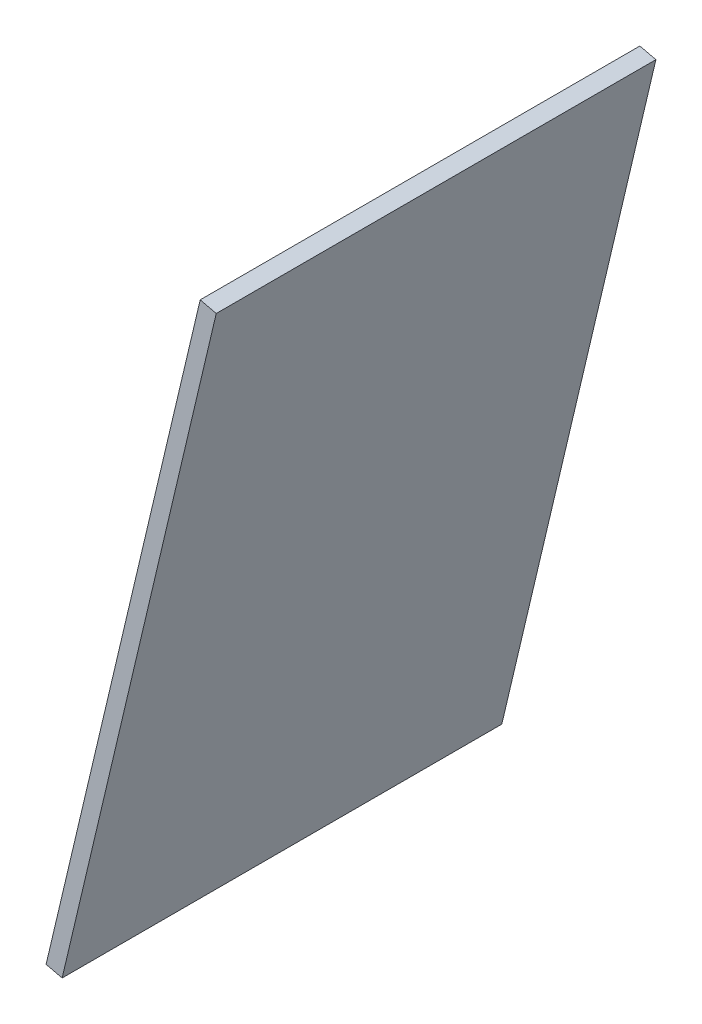
ISO-10303-21;
HEADER;
FILE_DESCRIPTION(('STEP AP214'),'2;1');
FILE_NAME('part.step','',(''),(''),'','','');
FILE_SCHEMA(('AUTOMOTIVE_DESIGN { 1 0 10303 214 1 1 1 1 }'));
ENDSEC;
DATA;
#1=APPLICATION_CONTEXT('core data for automotive mechanical design processes');
#2=APPLICATION_PROTOCOL_DEFINITION('international standard','automotive_design',2000,#1);
#3=PRODUCT_CONTEXT('',#1,'mechanical');
#4=PRODUCT('Part','Part','',(#3));
#5=PRODUCT_RELATED_PRODUCT_CATEGORY('part','',(#4));
#6=PRODUCT_DEFINITION_FORMATION('','',#4);
#7=PRODUCT_DEFINITION_CONTEXT('part definition',#1,'design');
#8=PRODUCT_DEFINITION('design','',#6,#7);
#9=PRODUCT_DEFINITION_SHAPE('','',#8);
#10=(LENGTH_UNIT() NAMED_UNIT(*) SI_UNIT(.MILLI.,.METRE.));
#11=(NAMED_UNIT(*) PLANE_ANGLE_UNIT() SI_UNIT($,.RADIAN.));
#12=(NAMED_UNIT(*) SI_UNIT($,.STERADIAN.) SOLID_ANGLE_UNIT());
#13=UNCERTAINTY_MEASURE_WITH_UNIT(LENGTH_MEASURE(1.E-05),#10,'distance_accuracy_value','');
#14=(GEOMETRIC_REPRESENTATION_CONTEXT(3) GLOBAL_UNCERTAINTY_ASSIGNED_CONTEXT((#13)) GLOBAL_UNIT_ASSIGNED_CONTEXT((#10,
#11,#12)) REPRESENTATION_CONTEXT('',''));
#15=CARTESIAN_POINT('',(0.,0.,0.));
#16=DIRECTION('',(0.,0.,1.));
#17=DIRECTION('',(1.,0.,0.));
#18=AXIS2_PLACEMENT_3D('',#15,#16,#17);
#19=CARTESIAN_POINT('',(-323.351397807189,-1022.46704409247,6202.07013677008));
#20=DIRECTION('',(-0.22983258438349,-0.973230179944912,0.));
#21=DIRECTION('',(0.973230179944912,-0.22983258438349,0.));
#22=AXIS2_PLACEMENT_3D('',#19,#20,#21);
#23=PLANE('',#22);
#24=DIRECTION('',(0.,0.,-1.));
#25=VECTOR('',#24,1.);
#26=CARTESIAN_POINT('',(-320.431707267354,-1023.15654184562,6202.07013677008));
#27=LINE('',#26,#25);
#28=CARTESIAN_POINT('',(-320.431707267354,-1023.15654184562,6202.07013677008));
#29=VERTEX_POINT('',#28);
#30=CARTESIAN_POINT('',(-320.431707267354,-1023.15654184562,6122.07013677008));
#31=VERTEX_POINT('',#30);
#32=EDGE_CURVE('E96',#29,#31,#27,.T.);
#33=ORIENTED_EDGE('',*,*,#32,.T.);
#34=DIRECTION('',(0.973230179944912,-0.22983258438349,0.));
#35=VECTOR('',#34,1.);
#36=CARTESIAN_POINT('',(-323.351397807189,-1022.46704409247,6122.07013677008));
#37=LINE('',#36,#35);
#38=CARTESIAN_POINT('',(-323.351397807189,-1022.46704409247,6122.07013677008));
#39=VERTEX_POINT('',#38);
#40=EDGE_CURVE('E11',#39,#31,#37,.T.);
#41=ORIENTED_EDGE('',*,*,#40,.F.);
#42=DIRECTION('',(0.,0.,-1.));
#43=VECTOR('',#42,1.);
#44=CARTESIAN_POINT('',(-323.351397807189,-1022.46704409247,6202.07013677008));
#45=LINE('',#44,#43);
#46=CARTESIAN_POINT('',(-323.351397807189,-1022.46704409247,6202.07013677008));
#47=VERTEX_POINT('',#46);
#48=EDGE_CURVE('E84',#47,#39,#45,.T.);
#49=ORIENTED_EDGE('',*,*,#48,.F.);
#50=DIRECTION('',(0.973230179944912,-0.22983258438349,0.));
#51=VECTOR('',#50,1.);
#52=CARTESIAN_POINT('',(-323.351397807189,-1022.46704409247,6202.07013677008));
#53=LINE('',#52,#51);
#54=EDGE_CURVE('E92',#47,#29,#53,.T.);
#55=ORIENTED_EDGE('',*,*,#54,.T.);
#56=EDGE_LOOP('',(#33,#41,#49,#55));
#57=FACE_BOUND('',#56,.T.);
#58=ADVANCED_FACE('F33',(#57),#23,.F.);
#59=CARTESIAN_POINT('',(-323.351397807189,-1022.46704409247,6122.07013677008));
#60=DIRECTION('',(0.,0.,1.));
#61=DIRECTION('',(1.,0.,0.));
#62=AXIS2_PLACEMENT_3D('',#59,#60,#61);
#63=PLANE('',#62);
#64=DIRECTION('',(-0.22983258438349,-0.973230179944912,0.));
#65=VECTOR('',#64,1.);
#66=CARTESIAN_POINT('',(-320.431707267354,-1023.15654184562,6122.07013677008));
#67=LINE('',#66,#65);
#68=CARTESIAN_POINT('',(-348.47128256214,-1141.8906237989,6122.07013677008));
#69=VERTEX_POINT('',#68);
#70=EDGE_CURVE('E88',#31,#69,#67,.T.);
#71=ORIENTED_EDGE('',*,*,#70,.T.);
#72=DIRECTION('',(0.973230179944912,-0.22983258438349,0.));
#73=VECTOR('',#72,1.);
#74=CARTESIAN_POINT('',(-351.390973101975,-1141.20112604574,6122.07013677008));
#75=LINE('',#74,#73);
#76=CARTESIAN_POINT('',(-351.390973101975,-1141.20112604574,6122.07013677008));
#77=VERTEX_POINT('',#76);
#78=EDGE_CURVE('E41',#77,#69,#75,.T.);
#79=ORIENTED_EDGE('',*,*,#78,.F.);
#80=DIRECTION('',(-0.22983258438349,-0.973230179944912,0.));
#81=VECTOR('',#80,1.);
#82=CARTESIAN_POINT('',(-323.351397807189,-1022.46704409247,6122.07013677008));
#83=LINE('',#82,#81);
#84=EDGE_CURVE('E79',#39,#77,#83,.T.);
#85=ORIENTED_EDGE('',*,*,#84,.F.);
#86=ORIENTED_EDGE('',*,*,#40,.T.);
#87=EDGE_LOOP('',(#71,#79,#85,#86));
#88=FACE_BOUND('',#87,.T.);
#89=ADVANCED_FACE('F87',(#88),#63,.F.);
#90=CARTESIAN_POINT('',(-351.390973101975,-1141.20112604574,6202.07013677008));
#91=DIRECTION('',(0.22983258438349,0.973230179944912,0.));
#92=DIRECTION('',(-0.973230179944912,0.22983258438349,0.));
#93=AXIS2_PLACEMENT_3D('',#90,#91,#92);
#94=PLANE('',#93);
#95=DIRECTION('',(0.,0.,1.));
#96=VECTOR('',#95,1.);
#97=CARTESIAN_POINT('',(-348.47128256214,-1141.8906237989,6202.07013677008));
#98=LINE('',#97,#96);
#99=CARTESIAN_POINT('',(-348.47128256214,-1141.8906237989,6202.07013677008));
#100=VERTEX_POINT('',#99);
#101=EDGE_CURVE('E66',#69,#100,#98,.T.);
#102=ORIENTED_EDGE('',*,*,#101,.T.);
#103=DIRECTION('',(0.973230179944912,-0.22983258438349,0.));
#104=VECTOR('',#103,1.);
#105=CARTESIAN_POINT('',(-351.390973101975,-1141.20112604574,6202.07013677008));
#106=LINE('',#105,#104);
#107=CARTESIAN_POINT('',(-351.390973101975,-1141.20112604574,6202.07013677008));
#108=VERTEX_POINT('',#107);
#109=EDGE_CURVE('E89',#108,#100,#106,.T.);
#110=ORIENTED_EDGE('',*,*,#109,.F.);
#111=DIRECTION('',(0.,0.,1.));
#112=VECTOR('',#111,1.);
#113=CARTESIAN_POINT('',(-351.390973101975,-1141.20112604574,6202.07013677008));
#114=LINE('',#113,#112);
#115=EDGE_CURVE('E82',#77,#108,#114,.T.);
#116=ORIENTED_EDGE('',*,*,#115,.F.);
#117=ORIENTED_EDGE('',*,*,#78,.T.);
#118=EDGE_LOOP('',(#102,#110,#116,#117));
#119=FACE_BOUND('',#118,.T.);
#120=ADVANCED_FACE('F90',(#119),#94,.F.);
#121=CARTESIAN_POINT('',(-323.351397807189,-1022.46704409247,6202.07013677008));
#122=DIRECTION('',(0.,0.,-1.));
#123=DIRECTION('',(-1.,0.,0.));
#124=AXIS2_PLACEMENT_3D('',#121,#122,#123);
#125=PLANE('',#124);
#126=DIRECTION('',(0.22983258438349,0.973230179944912,0.));
#127=VECTOR('',#126,1.);
#128=CARTESIAN_POINT('',(-320.431707267354,-1023.15654184562,6202.07013677008));
#129=LINE('',#128,#127);
#130=EDGE_CURVE('E72',#100,#29,#129,.T.);
#131=ORIENTED_EDGE('',*,*,#130,.T.);
#132=ORIENTED_EDGE('',*,*,#54,.F.);
#133=DIRECTION('',(0.22983258438349,0.973230179944912,0.));
#134=VECTOR('',#133,1.);
#135=CARTESIAN_POINT('',(-323.351397807189,-1022.46704409247,6202.07013677008));
#136=LINE('',#135,#134);
#137=EDGE_CURVE('E49',#108,#47,#136,.T.);
#138=ORIENTED_EDGE('',*,*,#137,.F.);
#139=ORIENTED_EDGE('',*,*,#109,.T.);
#140=EDGE_LOOP('',(#131,#132,#138,#139));
#141=FACE_BOUND('',#140,.T.);
#142=ADVANCED_FACE('F103',(#141),#125,.F.);
#143=CARTESIAN_POINT('',(-77.5655654272751,18.3174491797268,0.));
#144=DIRECTION('',(-0.973230179944912,0.22983258438349,0.));
#145=DIRECTION('',(-0.22983258438349,-0.973230179944912,0.));
#146=AXIS2_PLACEMENT_3D('',#143,#144,#145);
#147=PLANE('',#146);
#148=ORIENTED_EDGE('',*,*,#48,.T.);
#149=ORIENTED_EDGE('',*,*,#84,.T.);
#150=ORIENTED_EDGE('',*,*,#115,.T.);
#151=ORIENTED_EDGE('',*,*,#137,.T.);
#152=EDGE_LOOP('',(#148,#149,#150,#151));
#153=FACE_BOUND('',#152,.T.);
#154=ADVANCED_FACE('F80',(#153),#147,.T.);
#155=CARTESIAN_POINT('',(-74.6458748874403,17.6279514265764,0.));
#156=DIRECTION('',(-0.973230179944912,0.22983258438349,0.));
#157=DIRECTION('',(-0.22983258438349,-0.973230179944912,0.));
#158=AXIS2_PLACEMENT_3D('',#155,#156,#157);
#159=PLANE('',#158);
#160=ORIENTED_EDGE('',*,*,#32,.F.);
#161=ORIENTED_EDGE('',*,*,#130,.F.);
#162=ORIENTED_EDGE('',*,*,#101,.F.);
#163=ORIENTED_EDGE('',*,*,#70,.F.);
#164=EDGE_LOOP('',(#160,#161,#162,#163));
#165=FACE_BOUND('',#164,.T.);
#166=ADVANCED_FACE('F106',(#165),#159,.F.);
#167=CLOSED_SHELL('',(#58,#89,#120,#142,#154,#166));
#168=MANIFOLD_SOLID_BREP('B2',#167);
#169=ADVANCED_BREP_SHAPE_REPRESENTATION('',(#18,#168),#14);
#170=SHAPE_DEFINITION_REPRESENTATION(#9,#169);
ENDSEC;
END-ISO-10303-21;
